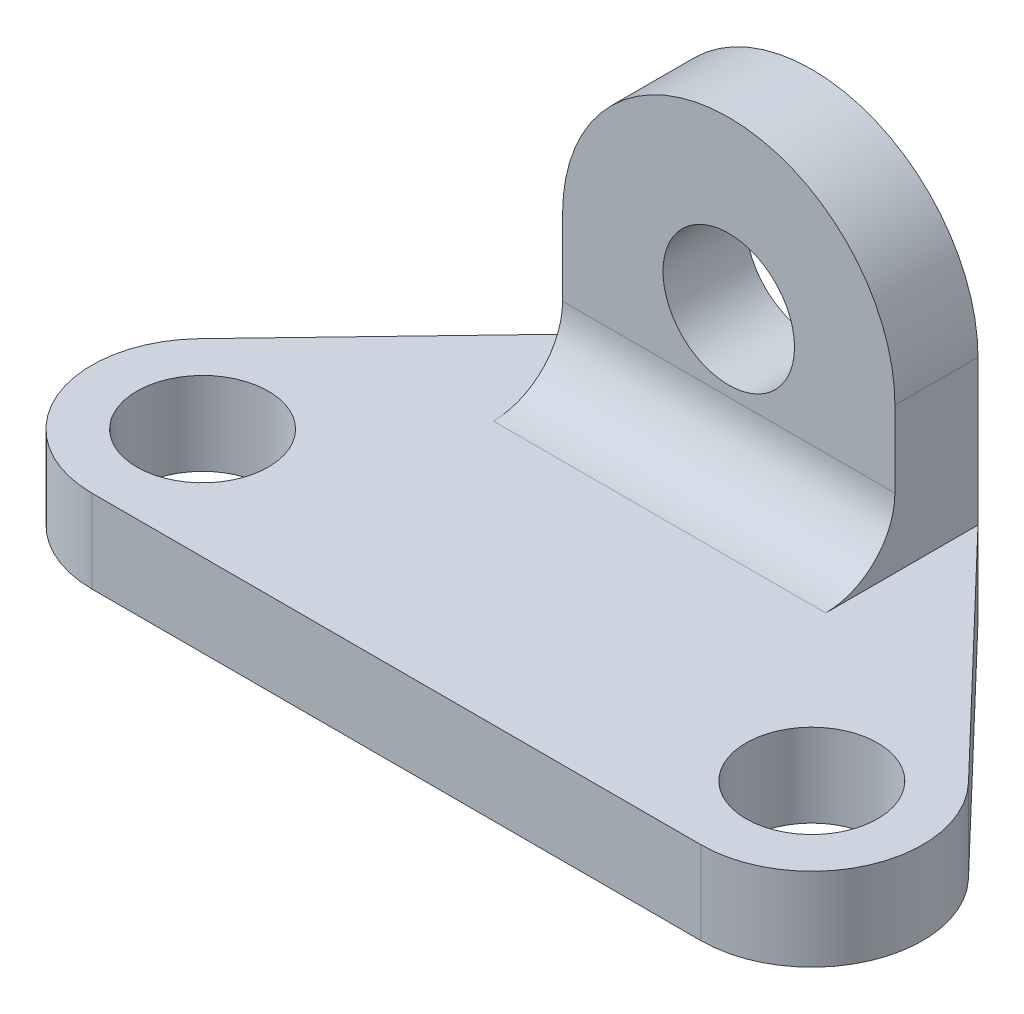
ISO-10303-21;
HEADER;
FILE_DESCRIPTION(('STEP AP214'),'2;1');
FILE_NAME('part.step','',(''),(''),'','','');
FILE_SCHEMA(('AUTOMOTIVE_DESIGN { 1 0 10303 214 1 1 1 1 }'));
ENDSEC;
DATA;
#1=APPLICATION_CONTEXT('core data for automotive mechanical design processes');
#2=APPLICATION_PROTOCOL_DEFINITION('international standard','automotive_design',2000,#1);
#3=PRODUCT_CONTEXT('',#1,'mechanical');
#4=PRODUCT('Part','Part','',(#3));
#5=PRODUCT_RELATED_PRODUCT_CATEGORY('part','',(#4));
#6=PRODUCT_DEFINITION_FORMATION('','',#4);
#7=PRODUCT_DEFINITION_CONTEXT('part definition',#1,'design');
#8=PRODUCT_DEFINITION('design','',#6,#7);
#9=PRODUCT_DEFINITION_SHAPE('','',#8);
#10=(LENGTH_UNIT() NAMED_UNIT(*) SI_UNIT(.MILLI.,.METRE.));
#11=(NAMED_UNIT(*) PLANE_ANGLE_UNIT() SI_UNIT($,.RADIAN.));
#12=(NAMED_UNIT(*) SI_UNIT($,.STERADIAN.) SOLID_ANGLE_UNIT());
#13=UNCERTAINTY_MEASURE_WITH_UNIT(LENGTH_MEASURE(1.E-05),#10,'distance_accuracy_value','');
#14=(GEOMETRIC_REPRESENTATION_CONTEXT(3) GLOBAL_UNCERTAINTY_ASSIGNED_CONTEXT((#13)) GLOBAL_UNIT_ASSIGNED_CONTEXT((#10,
#11,#12)) REPRESENTATION_CONTEXT('',''));
#15=CARTESIAN_POINT('',(0.,0.,0.));
#16=DIRECTION('',(0.,0.,1.));
#17=DIRECTION('',(1.,0.,0.));
#18=AXIS2_PLACEMENT_3D('',#15,#16,#17);
#19=CARTESIAN_POINT('',(-44.,12.,0.));
#20=DIRECTION('',(0.,1.,0.));
#21=DIRECTION('',(0.,0.,1.));
#22=AXIS2_PLACEMENT_3D('',#19,#20,#21);
#23=PLANE('',#22);
#24=CARTESIAN_POINT('',(-44.,12.,0.));
#25=DIRECTION('',(0.,1.,0.));
#26=DIRECTION('',(0.,0.,1.));
#27=AXIS2_PLACEMENT_3D('',#24,#25,#26);
#28=CIRCLE('',#27,9.5);
#29=CARTESIAN_POINT('',(-44.,12.,9.5));
#30=VERTEX_POINT('',#29);
#31=EDGE_CURVE('E162',#30,#30,#28,.T.);
#32=ORIENTED_EDGE('',*,*,#31,.F.);
#33=EDGE_LOOP('',(#32));
#34=FACE_BOUND('',#33,.T.);
#35=CARTESIAN_POINT('',(44.,12.,0.));
#36=DIRECTION('',(0.,1.,0.));
#37=DIRECTION('',(0.,0.,1.));
#38=AXIS2_PLACEMENT_3D('',#35,#36,#37);
#39=CIRCLE('',#38,9.5);
#40=CARTESIAN_POINT('',(44.,12.,9.5));
#41=VERTEX_POINT('',#40);
#42=EDGE_CURVE('E171',#41,#41,#39,.T.);
#43=ORIENTED_EDGE('',*,*,#42,.F.);
#44=EDGE_LOOP('',(#43));
#45=FACE_BOUND('',#44,.T.);
#46=DIRECTION('',(-1.,0.,0.));
#47=VECTOR('',#46,1.);
#48=CARTESIAN_POINT('',(-44.,12.,-22.));
#49=LINE('',#48,#47);
#50=CARTESIAN_POINT('',(24.,12.,-22.));
#51=VERTEX_POINT('',#50);
#52=CARTESIAN_POINT('',(-24.,12.,-22.));
#53=VERTEX_POINT('',#52);
#54=EDGE_CURVE('E236',#51,#53,#49,.T.);
#55=ORIENTED_EDGE('',*,*,#54,.T.);
#56=DIRECTION('',(0.,0.,-1.));
#57=VECTOR('',#56,1.);
#58=CARTESIAN_POINT('',(-24.,12.,0.));
#59=LINE('',#58,#57);
#60=CARTESIAN_POINT('',(-24.,12.,-44.));
#61=VERTEX_POINT('',#60);
#62=EDGE_CURVE('E157',#53,#61,#59,.T.);
#63=ORIENTED_EDGE('',*,*,#62,.T.);
#64=DIRECTION('',(-0.691840899006554,0.,0.722049977814419));
#65=VECTOR('',#64,1.);
#66=CARTESIAN_POINT('',(-55.5527996450307,12.,-11.0694543841049));
#67=LINE('',#66,#65);
#68=CARTESIAN_POINT('',(-55.5527996450307,12.,-11.0694543841049));
#69=VERTEX_POINT('',#68);
#70=EDGE_CURVE('E192',#61,#69,#67,.T.);
#71=ORIENTED_EDGE('',*,*,#70,.T.);
#72=CARTESIAN_POINT('',(-44.,12.,0.));
#73=DIRECTION('',(0.,1.,0.));
#74=DIRECTION('',(0.,0.,1.));
#75=AXIS2_PLACEMENT_3D('',#72,#73,#74);
#76=CIRCLE('',#75,16.);
#77=CARTESIAN_POINT('',(-44.,12.,16.));
#78=VERTEX_POINT('',#77);
#79=EDGE_CURVE('E178',#69,#78,#76,.T.);
#80=ORIENTED_EDGE('',*,*,#79,.T.);
#81=DIRECTION('',(1.,0.,0.));
#82=VECTOR('',#81,1.);
#83=CARTESIAN_POINT('',(-44.,12.,16.));
#84=LINE('',#83,#82);
#85=CARTESIAN_POINT('',(44.,12.,16.));
#86=VERTEX_POINT('',#85);
#87=EDGE_CURVE('E182',#78,#86,#84,.T.);
#88=ORIENTED_EDGE('',*,*,#87,.T.);
#89=CARTESIAN_POINT('',(44.,12.,0.));
#90=DIRECTION('',(0.,1.,0.));
#91=DIRECTION('',(0.,0.,1.));
#92=AXIS2_PLACEMENT_3D('',#89,#90,#91);
#93=CIRCLE('',#92,16.);
#94=CARTESIAN_POINT('',(55.5527996450307,12.,-11.0694543841049));
#95=VERTEX_POINT('',#94);
#96=EDGE_CURVE('E186',#86,#95,#93,.T.);
#97=ORIENTED_EDGE('',*,*,#96,.T.);
#98=DIRECTION('',(-0.691840899006554,0.,-0.722049977814419));
#99=VECTOR('',#98,1.);
#100=CARTESIAN_POINT('',(24.,12.,-44.));
#101=LINE('',#100,#99);
#102=CARTESIAN_POINT('',(24.,12.,-44.));
#103=VERTEX_POINT('',#102);
#104=EDGE_CURVE('E189',#95,#103,#101,.T.);
#105=ORIENTED_EDGE('',*,*,#104,.T.);
#106=DIRECTION('',(0.,0.,-1.));
#107=VECTOR('',#106,1.);
#108=CARTESIAN_POINT('',(24.,12.,0.));
#109=LINE('',#108,#107);
#110=EDGE_CURVE('E129',#51,#103,#109,.T.);
#111=ORIENTED_EDGE('',*,*,#110,.F.);
#112=EDGE_LOOP('',(#55,#63,#71,#80,#88,#97,#105,#111));
#113=FACE_BOUND('',#112,.T.);
#114=ADVANCED_FACE('F39',(#34,#45,#113),#23,.T.);
#115=CARTESIAN_POINT('',(-44.,12.,0.));
#116=DIRECTION('',(0.,-1.,0.));
#117=DIRECTION('',(0.,0.,-1.));
#118=AXIS2_PLACEMENT_3D('',#115,#116,#117);
#119=CYLINDRICAL_SURFACE('',#118,16.);
#120=CARTESIAN_POINT('',(-44.,0.,0.));
#121=DIRECTION('',(0.,1.,0.));
#122=DIRECTION('',(0.,0.,1.));
#123=AXIS2_PLACEMENT_3D('',#120,#121,#122);
#124=CIRCLE('',#123,16.);
#125=CARTESIAN_POINT('',(-55.5527996450307,0.,-11.0694543841049));
#126=VERTEX_POINT('',#125);
#127=CARTESIAN_POINT('',(-44.,0.,16.));
#128=VERTEX_POINT('',#127);
#129=EDGE_CURVE('E166',#126,#128,#124,.T.);
#130=ORIENTED_EDGE('',*,*,#129,.T.);
#131=DIRECTION('',(0.,-1.,0.));
#132=VECTOR('',#131,1.);
#133=CARTESIAN_POINT('',(-44.,12.,16.));
#134=LINE('',#133,#132);
#135=EDGE_CURVE('E232',#78,#128,#134,.T.);
#136=ORIENTED_EDGE('',*,*,#135,.F.);
#137=ORIENTED_EDGE('',*,*,#79,.F.);
#138=DIRECTION('',(0.,-1.,0.));
#139=VECTOR('',#138,1.);
#140=CARTESIAN_POINT('',(-55.5527996450307,12.,-11.0694543841049));
#141=LINE('',#140,#139);
#142=EDGE_CURVE('E195',#69,#126,#141,.T.);
#143=ORIENTED_EDGE('',*,*,#142,.T.);
#144=EDGE_LOOP('',(#130,#136,#137,#143));
#145=FACE_BOUND('',#144,.T.);
#146=ADVANCED_FACE('F276',(#145),#119,.T.);
#147=CARTESIAN_POINT('',(-44.,12.,16.));
#148=DIRECTION('',(0.,0.,-1.));
#149=DIRECTION('',(-1.,0.,0.));
#150=AXIS2_PLACEMENT_3D('',#147,#148,#149);
#151=PLANE('',#150);
#152=DIRECTION('',(1.,0.,0.));
#153=VECTOR('',#152,1.);
#154=CARTESIAN_POINT('',(-44.,0.,16.));
#155=LINE('',#154,#153);
#156=CARTESIAN_POINT('',(44.,0.,16.));
#157=VERTEX_POINT('',#156);
#158=EDGE_CURVE('E199',#128,#157,#155,.T.);
#159=ORIENTED_EDGE('',*,*,#158,.T.);
#160=DIRECTION('',(0.,-1.,0.));
#161=VECTOR('',#160,1.);
#162=CARTESIAN_POINT('',(44.,12.,16.));
#163=LINE('',#162,#161);
#164=EDGE_CURVE('E228',#86,#157,#163,.T.);
#165=ORIENTED_EDGE('',*,*,#164,.F.);
#166=ORIENTED_EDGE('',*,*,#87,.F.);
#167=ORIENTED_EDGE('',*,*,#135,.T.);
#168=EDGE_LOOP('',(#159,#165,#166,#167));
#169=FACE_BOUND('',#168,.T.);
#170=ADVANCED_FACE('F282',(#169),#151,.F.);
#171=CARTESIAN_POINT('',(44.,12.,0.));
#172=DIRECTION('',(0.,-1.,0.));
#173=DIRECTION('',(0.,0.,-1.));
#174=AXIS2_PLACEMENT_3D('',#171,#172,#173);
#175=CYLINDRICAL_SURFACE('',#174,16.);
#176=CARTESIAN_POINT('',(44.,0.,0.));
#177=DIRECTION('',(0.,1.,0.));
#178=DIRECTION('',(0.,0.,1.));
#179=AXIS2_PLACEMENT_3D('',#176,#177,#178);
#180=CIRCLE('',#179,16.);
#181=CARTESIAN_POINT('',(55.5527996450307,0.,-11.0694543841049));
#182=VERTEX_POINT('',#181);
#183=EDGE_CURVE('E202',#157,#182,#180,.T.);
#184=ORIENTED_EDGE('',*,*,#183,.T.);
#185=DIRECTION('',(0.,-1.,0.));
#186=VECTOR('',#185,1.);
#187=CARTESIAN_POINT('',(55.5527996450307,12.,-11.0694543841049));
#188=LINE('',#187,#186);
#189=EDGE_CURVE('E224',#95,#182,#188,.T.);
#190=ORIENTED_EDGE('',*,*,#189,.F.);
#191=ORIENTED_EDGE('',*,*,#96,.F.);
#192=ORIENTED_EDGE('',*,*,#164,.T.);
#193=EDGE_LOOP('',(#184,#190,#191,#192));
#194=FACE_BOUND('',#193,.T.);
#195=ADVANCED_FACE('F303',(#194),#175,.T.);
#196=CARTESIAN_POINT('',(24.,12.,-44.));
#197=DIRECTION('',(-0.722049977814419,0.,0.691840899006554));
#198=DIRECTION('',(0.691840899006554,0.,0.722049977814419));
#199=AXIS2_PLACEMENT_3D('',#196,#197,#198);
#200=PLANE('',#199);
#201=DIRECTION('',(-0.691840899006554,0.,-0.722049977814419));
#202=VECTOR('',#201,1.);
#203=CARTESIAN_POINT('',(24.,0.,-44.));
#204=LINE('',#203,#202);
#205=CARTESIAN_POINT('',(24.,0.,-44.));
#206=VERTEX_POINT('',#205);
#207=EDGE_CURVE('E205',#182,#206,#204,.T.);
#208=ORIENTED_EDGE('',*,*,#207,.T.);
#209=DIRECTION('',(0.,-1.,0.));
#210=VECTOR('',#209,1.);
#211=CARTESIAN_POINT('',(24.,12.,-44.));
#212=LINE('',#211,#210);
#213=EDGE_CURVE('E220',#103,#206,#212,.T.);
#214=ORIENTED_EDGE('',*,*,#213,.F.);
#215=ORIENTED_EDGE('',*,*,#104,.F.);
#216=ORIENTED_EDGE('',*,*,#189,.T.);
#217=EDGE_LOOP('',(#208,#214,#215,#216));
#218=FACE_BOUND('',#217,.T.);
#219=ADVANCED_FACE('F300',(#218),#200,.F.);
#220=CARTESIAN_POINT('',(-24.,12.,-44.));
#221=DIRECTION('',(0.,0.,1.));
#222=DIRECTION('',(1.,0.,0.));
#223=AXIS2_PLACEMENT_3D('',#220,#221,#222);
#224=PLANE('',#223);
#225=CARTESIAN_POINT('',(0.,33.,-44.));
#226=DIRECTION('',(0.,0.,1.));
#227=DIRECTION('',(1.,0.,0.));
#228=AXIS2_PLACEMENT_3D('',#225,#226,#227);
#229=CIRCLE('',#228,9.5);
#230=CARTESIAN_POINT('',(9.49999999999999,33.,-44.));
#231=VERTEX_POINT('',#230);
#232=EDGE_CURVE('E149',#231,#231,#229,.T.);
#233=ORIENTED_EDGE('',*,*,#232,.T.);
#234=EDGE_LOOP('',(#233));
#235=FACE_BOUND('',#234,.T.);
#236=DIRECTION('',(-1.,0.,0.));
#237=VECTOR('',#236,1.);
#238=CARTESIAN_POINT('',(-24.,0.,-44.));
#239=LINE('',#238,#237);
#240=CARTESIAN_POINT('',(-24.,0.,-44.));
#241=VERTEX_POINT('',#240);
#242=EDGE_CURVE('E208',#206,#241,#239,.T.);
#243=ORIENTED_EDGE('',*,*,#242,.T.);
#244=DIRECTION('',(0.,-1.,0.));
#245=VECTOR('',#244,1.);
#246=CARTESIAN_POINT('',(-24.,12.,-44.));
#247=LINE('',#246,#245);
#248=EDGE_CURVE('E216',#61,#241,#247,.T.);
#249=ORIENTED_EDGE('',*,*,#248,.F.);
#250=DIRECTION('',(0.,-1.,0.));
#251=VECTOR('',#250,1.);
#252=CARTESIAN_POINT('',(-24.,33.,-44.));
#253=LINE('',#252,#251);
#254=CARTESIAN_POINT('',(-24.,33.,-44.));
#255=VERTEX_POINT('',#254);
#256=EDGE_CURVE('E145',#255,#61,#253,.T.);
#257=ORIENTED_EDGE('',*,*,#256,.F.);
#258=CARTESIAN_POINT('',(0.,33.,-44.));
#259=DIRECTION('',(0.,0.,-1.));
#260=DIRECTION('',(-1.,0.,0.));
#261=AXIS2_PLACEMENT_3D('',#258,#259,#260);
#262=CIRCLE('',#261,24.);
#263=CARTESIAN_POINT('',(24.,33.,-44.));
#264=VERTEX_POINT('',#263);
#265=EDGE_CURVE('E152',#255,#264,#262,.T.);
#266=ORIENTED_EDGE('',*,*,#265,.T.);
#267=DIRECTION('',(0.,-1.,0.));
#268=VECTOR('',#267,1.);
#269=CARTESIAN_POINT('',(24.,33.,-44.));
#270=LINE('',#269,#268);
#271=EDGE_CURVE('E123',#264,#103,#270,.T.);
#272=ORIENTED_EDGE('',*,*,#271,.T.);
#273=ORIENTED_EDGE('',*,*,#213,.T.);
#274=EDGE_LOOP('',(#243,#249,#257,#266,#272,#273));
#275=FACE_BOUND('',#274,.T.);
#276=ADVANCED_FACE('F246',(#235,#275),#224,.F.);
#277=CARTESIAN_POINT('',(-55.5527996450307,12.,-11.0694543841049));
#278=DIRECTION('',(0.722049977814419,0.,0.691840899006554));
#279=DIRECTION('',(0.691840899006554,0.,-0.722049977814419));
#280=AXIS2_PLACEMENT_3D('',#277,#278,#279);
#281=PLANE('',#280);
#282=DIRECTION('',(-0.691840899006554,0.,0.722049977814419));
#283=VECTOR('',#282,1.);
#284=CARTESIAN_POINT('',(-55.5527996450307,0.,-11.0694543841049));
#285=LINE('',#284,#283);
#286=EDGE_CURVE('E183',#241,#126,#285,.T.);
#287=ORIENTED_EDGE('',*,*,#286,.T.);
#288=ORIENTED_EDGE('',*,*,#142,.F.);
#289=ORIENTED_EDGE('',*,*,#70,.F.);
#290=ORIENTED_EDGE('',*,*,#248,.T.);
#291=EDGE_LOOP('',(#287,#288,#289,#290));
#292=FACE_BOUND('',#291,.T.);
#293=ADVANCED_FACE('F293',(#292),#281,.F.);
#294=CARTESIAN_POINT('',(-44.,0.,0.));
#295=DIRECTION('',(0.,1.,0.));
#296=DIRECTION('',(0.,0.,1.));
#297=AXIS2_PLACEMENT_3D('',#294,#295,#296);
#298=PLANE('',#297);
#299=ORIENTED_EDGE('',*,*,#286,.F.);
#300=ORIENTED_EDGE('',*,*,#242,.F.);
#301=ORIENTED_EDGE('',*,*,#207,.F.);
#302=ORIENTED_EDGE('',*,*,#183,.F.);
#303=ORIENTED_EDGE('',*,*,#158,.F.);
#304=ORIENTED_EDGE('',*,*,#129,.F.);
#305=EDGE_LOOP('',(#299,#300,#301,#302,#303,#304));
#306=FACE_BOUND('',#305,.T.);
#307=CARTESIAN_POINT('',(44.,0.,0.));
#308=DIRECTION('',(0.,1.,0.));
#309=DIRECTION('',(0.,0.,1.));
#310=AXIS2_PLACEMENT_3D('',#307,#308,#309);
#311=CIRCLE('',#310,9.5);
#312=CARTESIAN_POINT('',(44.,0.,9.5));
#313=VERTEX_POINT('',#312);
#314=EDGE_CURVE('E161',#313,#313,#311,.T.);
#315=ORIENTED_EDGE('',*,*,#314,.T.);
#316=EDGE_LOOP('',(#315));
#317=FACE_BOUND('',#316,.T.);
#318=CARTESIAN_POINT('',(-44.,0.,0.));
#319=DIRECTION('',(0.,1.,0.));
#320=DIRECTION('',(0.,0.,1.));
#321=AXIS2_PLACEMENT_3D('',#318,#319,#320);
#322=CIRCLE('',#321,9.5);
#323=CARTESIAN_POINT('',(-44.,0.,9.5));
#324=VERTEX_POINT('',#323);
#325=EDGE_CURVE('E167',#324,#324,#322,.T.);
#326=ORIENTED_EDGE('',*,*,#325,.T.);
#327=EDGE_LOOP('',(#326));
#328=FACE_BOUND('',#327,.T.);
#329=ADVANCED_FACE('F290',(#306,#317,#328),#298,.F.);
#330=CARTESIAN_POINT('',(44.,12.,0.));
#331=DIRECTION('',(0.,-1.,0.));
#332=DIRECTION('',(0.,0.,-1.));
#333=AXIS2_PLACEMENT_3D('',#330,#331,#332);
#334=CYLINDRICAL_SURFACE('',#333,9.5);
#335=ORIENTED_EDGE('',*,*,#42,.T.);
#336=EDGE_LOOP('',(#335));
#337=FACE_BOUND('',#336,.T.);
#338=ORIENTED_EDGE('',*,*,#314,.F.);
#339=EDGE_LOOP('',(#338));
#340=FACE_BOUND('',#339,.T.);
#341=ADVANCED_FACE('F288',(#337,#340),#334,.F.);
#342=CARTESIAN_POINT('',(-44.,12.,0.));
#343=DIRECTION('',(0.,-1.,0.));
#344=DIRECTION('',(0.,0.,-1.));
#345=AXIS2_PLACEMENT_3D('',#342,#343,#344);
#346=CYLINDRICAL_SURFACE('',#345,9.5);
#347=ORIENTED_EDGE('',*,*,#31,.T.);
#348=EDGE_LOOP('',(#347));
#349=FACE_BOUND('',#348,.T.);
#350=ORIENTED_EDGE('',*,*,#325,.F.);
#351=EDGE_LOOP('',(#350));
#352=FACE_BOUND('',#351,.T.);
#353=ADVANCED_FACE('F328',(#349,#352),#346,.F.);
#354=CARTESIAN_POINT('',(-24.,33.,-32.));
#355=DIRECTION('',(1.,0.,0.));
#356=DIRECTION('',(0.,1.,0.));
#357=AXIS2_PLACEMENT_3D('',#354,#355,#356);
#358=PLANE('',#357);
#359=ORIENTED_EDGE('',*,*,#62,.F.);
#360=CARTESIAN_POINT('',(-24.,22.,-22.));
#361=DIRECTION('',(1.,0.,0.));
#362=DIRECTION('',(0.,1.,0.));
#363=AXIS2_PLACEMENT_3D('',#360,#361,#362);
#364=CIRCLE('',#363,10.);
#365=CARTESIAN_POINT('',(-24.,22.,-32.));
#366=VERTEX_POINT('',#365);
#367=EDGE_CURVE('E48',#53,#366,#364,.T.);
#368=ORIENTED_EDGE('',*,*,#367,.T.);
#369=DIRECTION('',(0.,-1.,0.));
#370=VECTOR('',#369,1.);
#371=CARTESIAN_POINT('',(-24.,33.,-32.));
#372=LINE('',#371,#370);
#373=CARTESIAN_POINT('',(-24.,33.,-32.));
#374=VERTEX_POINT('',#373);
#375=EDGE_CURVE('E136',#374,#366,#372,.T.);
#376=ORIENTED_EDGE('',*,*,#375,.F.);
#377=DIRECTION('',(0.,0.,-1.));
#378=VECTOR('',#377,1.);
#379=CARTESIAN_POINT('',(-24.,33.,-32.));
#380=LINE('',#379,#378);
#381=EDGE_CURVE('E130',#374,#255,#380,.T.);
#382=ORIENTED_EDGE('',*,*,#381,.T.);
#383=ORIENTED_EDGE('',*,*,#256,.T.);
#384=EDGE_LOOP('',(#359,#368,#376,#382,#383));
#385=FACE_BOUND('',#384,.T.);
#386=ADVANCED_FACE('F251',(#385),#358,.F.);
#387=CARTESIAN_POINT('',(24.,33.,-32.));
#388=DIRECTION('',(1.,0.,0.));
#389=DIRECTION('',(0.,1.,0.));
#390=AXIS2_PLACEMENT_3D('',#387,#388,#389);
#391=PLANE('',#390);
#392=DIRECTION('',(0.,-1.,0.));
#393=VECTOR('',#392,1.);
#394=CARTESIAN_POINT('',(24.,33.,-32.));
#395=LINE('',#394,#393);
#396=CARTESIAN_POINT('',(24.,33.,-32.));
#397=VERTEX_POINT('',#396);
#398=CARTESIAN_POINT('',(24.,22.,-32.));
#399=VERTEX_POINT('',#398);
#400=EDGE_CURVE('E119',#397,#399,#395,.T.);
#401=ORIENTED_EDGE('',*,*,#400,.T.);
#402=CARTESIAN_POINT('',(24.,22.,-22.));
#403=DIRECTION('',(1.,0.,0.));
#404=DIRECTION('',(0.,1.,0.));
#405=AXIS2_PLACEMENT_3D('',#402,#403,#404);
#406=CIRCLE('',#405,10.);
#407=EDGE_CURVE('E11',#399,#51,#406,.F.);
#408=ORIENTED_EDGE('',*,*,#407,.T.);
#409=ORIENTED_EDGE('',*,*,#110,.T.);
#410=ORIENTED_EDGE('',*,*,#271,.F.);
#411=DIRECTION('',(0.,0.,-1.));
#412=VECTOR('',#411,1.);
#413=CARTESIAN_POINT('',(24.,33.,-32.));
#414=LINE('',#413,#412);
#415=EDGE_CURVE('E117',#397,#264,#414,.T.);
#416=ORIENTED_EDGE('',*,*,#415,.F.);
#417=EDGE_LOOP('',(#401,#408,#409,#410,#416));
#418=FACE_BOUND('',#417,.T.);
#419=ADVANCED_FACE('F118',(#418),#391,.T.);
#420=CARTESIAN_POINT('',(0.,33.,-32.));
#421=DIRECTION('',(0.,0.,-1.));
#422=DIRECTION('',(-1.,0.,0.));
#423=AXIS2_PLACEMENT_3D('',#420,#421,#422);
#424=CYLINDRICAL_SURFACE('',#423,24.);
#425=ORIENTED_EDGE('',*,*,#265,.F.);
#426=ORIENTED_EDGE('',*,*,#381,.F.);
#427=CARTESIAN_POINT('',(0.,33.,-32.));
#428=DIRECTION('',(0.,0.,-1.));
#429=DIRECTION('',(-1.,0.,0.));
#430=AXIS2_PLACEMENT_3D('',#427,#428,#429);
#431=CIRCLE('',#430,24.);
#432=EDGE_CURVE('E134',#374,#397,#431,.T.);
#433=ORIENTED_EDGE('',*,*,#432,.T.);
#434=ORIENTED_EDGE('',*,*,#415,.T.);
#435=EDGE_LOOP('',(#425,#426,#433,#434));
#436=FACE_BOUND('',#435,.T.);
#437=ADVANCED_FACE('F138',(#436),#424,.T.);
#438=CARTESIAN_POINT('',(0.,33.,-32.));
#439=DIRECTION('',(0.,0.,-1.));
#440=DIRECTION('',(-1.,0.,0.));
#441=AXIS2_PLACEMENT_3D('',#438,#439,#440);
#442=PLANE('',#441);
#443=CARTESIAN_POINT('',(0.,33.,-32.));
#444=DIRECTION('',(0.,0.,1.));
#445=DIRECTION('',(1.,0.,0.));
#446=AXIS2_PLACEMENT_3D('',#443,#444,#445);
#447=CIRCLE('',#446,9.5);
#448=CARTESIAN_POINT('',(9.49999999999999,33.,-32.));
#449=VERTEX_POINT('',#448);
#450=EDGE_CURVE('E254',#449,#449,#447,.T.);
#451=ORIENTED_EDGE('',*,*,#450,.F.);
#452=EDGE_LOOP('',(#451));
#453=FACE_BOUND('',#452,.T.);
#454=ORIENTED_EDGE('',*,*,#375,.T.);
#455=DIRECTION('',(-1.,0.,0.));
#456=VECTOR('',#455,1.);
#457=CARTESIAN_POINT('',(0.,22.,-32.));
#458=LINE('',#457,#456);
#459=EDGE_CURVE('E61',#366,#399,#458,.F.);
#460=ORIENTED_EDGE('',*,*,#459,.T.);
#461=ORIENTED_EDGE('',*,*,#400,.F.);
#462=ORIENTED_EDGE('',*,*,#432,.F.);
#463=EDGE_LOOP('',(#454,#460,#461,#462));
#464=FACE_BOUND('',#463,.T.);
#465=ADVANCED_FACE('F133',(#453,#464),#442,.F.);
#466=CARTESIAN_POINT('',(0.,33.,-44.));
#467=DIRECTION('',(0.,0.,1.));
#468=DIRECTION('',(1.,0.,0.));
#469=AXIS2_PLACEMENT_3D('',#466,#467,#468);
#470=CYLINDRICAL_SURFACE('',#469,9.5);
#471=ORIENTED_EDGE('',*,*,#232,.F.);
#472=EDGE_LOOP('',(#471));
#473=FACE_BOUND('',#472,.T.);
#474=ORIENTED_EDGE('',*,*,#450,.T.);
#475=EDGE_LOOP('',(#474));
#476=FACE_BOUND('',#475,.T.);
#477=ADVANCED_FACE('F263',(#473,#476),#470,.F.);
#478=CARTESIAN_POINT('',(-44.,22.,-22.));
#479=DIRECTION('',(-1.,0.,0.));
#480=DIRECTION('',(0.,0.,1.));
#481=AXIS2_PLACEMENT_3D('',#478,#479,#480);
#482=CYLINDRICAL_SURFACE('',#481,10.);
#483=ORIENTED_EDGE('',*,*,#407,.F.);
#484=ORIENTED_EDGE('',*,*,#459,.F.);
#485=ORIENTED_EDGE('',*,*,#367,.F.);
#486=ORIENTED_EDGE('',*,*,#54,.F.);
#487=EDGE_LOOP('',(#483,#484,#485,#486));
#488=FACE_BOUND('',#487,.T.);
#489=ADVANCED_FACE('F41',(#488),#482,.F.);
#490=CLOSED_SHELL('',(#114,#146,#170,#195,#219,#276,#293,#329,#341,#353,#386,#419,#437,#465,
#477,#489));
#491=MANIFOLD_SOLID_BREP('B2',#490);
#492=ADVANCED_BREP_SHAPE_REPRESENTATION('',(#18,#491),#14);
#493=SHAPE_DEFINITION_REPRESENTATION(#9,#492);
ENDSEC;
END-ISO-10303-21;
